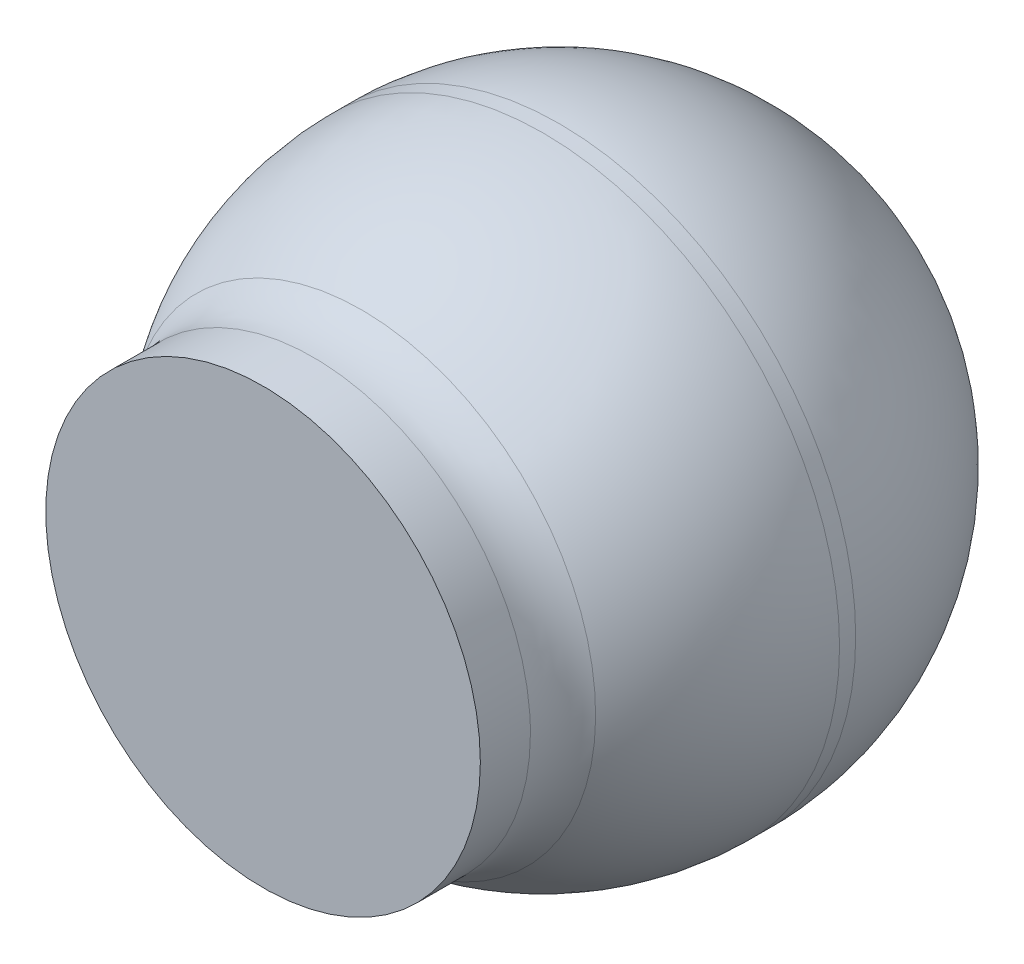
ISO-10303-21;
HEADER;
FILE_DESCRIPTION(('STEP AP214'),'2;1');
FILE_NAME('part.step','',(''),(''),'','','');
FILE_SCHEMA(('AUTOMOTIVE_DESIGN { 1 0 10303 214 1 1 1 1 }'));
ENDSEC;
DATA;
#1=APPLICATION_CONTEXT('core data for automotive mechanical design processes');
#2=APPLICATION_PROTOCOL_DEFINITION('international standard','automotive_design',2000,#1);
#3=PRODUCT_CONTEXT('',#1,'mechanical');
#4=PRODUCT('Part','Part','',(#3));
#5=PRODUCT_RELATED_PRODUCT_CATEGORY('part','',(#4));
#6=PRODUCT_DEFINITION_FORMATION('','',#4);
#7=PRODUCT_DEFINITION_CONTEXT('part definition',#1,'design');
#8=PRODUCT_DEFINITION('design','',#6,#7);
#9=PRODUCT_DEFINITION_SHAPE('','',#8);
#10=(LENGTH_UNIT() NAMED_UNIT(*) SI_UNIT(.MILLI.,.METRE.));
#11=(NAMED_UNIT(*) PLANE_ANGLE_UNIT() SI_UNIT($,.RADIAN.));
#12=(NAMED_UNIT(*) SI_UNIT($,.STERADIAN.) SOLID_ANGLE_UNIT());
#13=UNCERTAINTY_MEASURE_WITH_UNIT(LENGTH_MEASURE(1.E-05),#10,'distance_accuracy_value','');
#14=(GEOMETRIC_REPRESENTATION_CONTEXT(3) GLOBAL_UNCERTAINTY_ASSIGNED_CONTEXT((#13)) GLOBAL_UNIT_ASSIGNED_CONTEXT((#10,
#11,#12)) REPRESENTATION_CONTEXT('',''));
#15=CARTESIAN_POINT('',(0.,0.,0.));
#16=DIRECTION('',(0.,0.,1.));
#17=DIRECTION('',(1.,0.,0.));
#18=AXIS2_PLACEMENT_3D('',#15,#16,#17);
#19=CARTESIAN_POINT('',(-3.102919922269,-10.40134929145,10.006534503384));
#20=DIRECTION('',(0.,0.,-1.));
#21=DIRECTION('',(-1.,0.,0.));
#22=AXIS2_PLACEMENT_3D('',#19,#20,#21);
#23=PLANE('',#22);
#24=CARTESIAN_POINT('',(-3.102919922269,-10.40134929145,10.006534503384));
#25=DIRECTION('',(0.,0.,1.));
#26=DIRECTION('',(1.,0.,0.));
#27=AXIS2_PLACEMENT_3D('',#24,#25,#26);
#28=CIRCLE('',#27,0.275);
#29=CARTESIAN_POINT('',(-2.827919922269,-10.40134929145,10.006534503384));
#30=VERTEX_POINT('',#29);
#31=EDGE_CURVE('E20',#30,#30,#28,.F.);
#32=ORIENTED_EDGE('',*,*,#31,.F.);
#33=EDGE_LOOP('',(#32));
#34=FACE_BOUND('',#33,.T.);
#35=ADVANCED_FACE('F17',(#34),#23,.F.);
#36=CARTESIAN_POINT('',(-3.102919922269,-10.40134929145,9.906534503384));
#37=DIRECTION('',(0.,0.,1.));
#38=DIRECTION('',(1.,0.,0.));
#39=AXIS2_PLACEMENT_3D('',#36,#37,#38);
#40=CYLINDRICAL_SURFACE('',#39,0.275);
#41=CARTESIAN_POINT('',(-3.102919922269,-10.40134929145,9.943180457728));
#42=DIRECTION('',(0.,0.,-1.));
#43=DIRECTION('',(0.996700902337582,0.081162252799247,0.));
#44=AXIS2_PLACEMENT_3D('',#41,#42,#43);
#45=CIRCLE('',#44,0.275);
#46=CARTESIAN_POINT('',(-2.82882717412616,-10.3790296719302,9.943180457728));
#47=VERTEX_POINT('',#46);
#48=EDGE_CURVE('E66',#47,#47,#45,.F.);
#49=ORIENTED_EDGE('',*,*,#48,.T.);
#50=EDGE_LOOP('',(#49));
#51=FACE_BOUND('',#50,.T.);
#52=ORIENTED_EDGE('',*,*,#31,.T.);
#53=EDGE_LOOP('',(#52));
#54=FACE_BOUND('',#53,.T.);
#55=ADVANCED_FACE('F62',(#51,#54),#40,.T.);
#56=CARTESIAN_POINT('',(-3.102919922269,-10.40134929145,9.943180457728));
#57=DIRECTION('',(0.,0.,-1.));
#58=DIRECTION('',(0.996700902337583,0.0811622527992448,0.));
#59=AXIS2_PLACEMENT_3D('',#56,#57,#58);
#60=TOROIDAL_SURFACE('',#59,0.375,0.1);
#61=ORIENTED_EDGE('',*,*,#48,.F.);
#62=EDGE_LOOP('',(#61));
#63=FACE_BOUND('',#62,.T.);
#64=CARTESIAN_POINT('',(-3.102919922269,-10.40134929145,9.881744931236));
#65=DIRECTION('',(0.,0.,-1.));
#66=DIRECTION('',(-0.99670090233869,-0.0811622527856411,0.));
#67=AXIS2_PLACEMENT_3D('',#64,#65,#66);
#68=CIRCLE('',#67,0.29609704641234);
#69=CARTESIAN_POINT('',(-3.398040115608,-10.42538119478,9.881744931236));
#70=VERTEX_POINT('',#69);
#71=EDGE_CURVE('E39',#70,#70,#68,.T.);
#72=ORIENTED_EDGE('',*,*,#71,.F.);
#73=EDGE_LOOP('',(#72));
#74=FACE_BOUND('',#73,.T.);
#75=ADVANCED_FACE('F57',(#63,#74),#60,.F.);
#76=CARTESIAN_POINT('',(-3.476682760645,-10.43178513625,9.651976062157));
#77=CARTESIAN_POINT('',(-3.476682760645,-10.43178513625,9.701461392103));
#78=CARTESIAN_POINT('',(-3.468526217348,-10.43112094157,9.750947004335));
#79=CARTESIAN_POINT('',(-3.452207085349,-10.42979205995,9.798626332798));
#80=CARTESIAN_POINT('',(-3.428341390838,-10.42784865493,9.842699544317));
#81=CARTESIAN_POINT('',(-3.398040115608,-10.42538119478,9.881744931236));
#82=(BOUNDED_CURVE() B_SPLINE_CURVE(5,(#76,#77,#78,#79,#80,#81),.UNSPECIFIED.,.F.,
.F.) B_SPLINE_CURVE_WITH_KNOTS((6,6),(0.,0.661568582165),
.UNSPECIFIED.) CURVE() GEOMETRIC_REPRESENTATION_ITEM() RATIONAL_B_SPLINE_CURVE((1.,1.,1.,1.,1.,1.)) REPRESENTATION_ITEM(''));
#83=CARTESIAN_POINT('',(-3.102919922269,-10.40134929145,9.651976062157));
#84=DIRECTION('',(0.,0.,-1.));
#85=AXIS1_PLACEMENT('',#83,#84);
#86=SURFACE_OF_REVOLUTION('',#82,#85);
#87=CARTESIAN_POINT('',(-3.102919922269,-10.40134929145,9.651976062157));
#88=DIRECTION('',(0.,0.,1.));
#89=DIRECTION('',(1.,0.,0.));
#90=AXIS2_PLACEMENT_3D('',#87,#88,#89);
#91=CIRCLE('',#90,0.375);
#92=CARTESIAN_POINT('',(-2.727919922269,-10.40134929145,9.651976062157));
#93=VERTEX_POINT('',#92);
#94=EDGE_CURVE('E36',#93,#93,#91,.F.);
#95=ORIENTED_EDGE('',*,*,#94,.F.);
#96=EDGE_LOOP('',(#95));
#97=FACE_BOUND('',#96,.T.);
#98=ORIENTED_EDGE('',*,*,#71,.T.);
#99=EDGE_LOOP('',(#98));
#100=FACE_BOUND('',#99,.T.);
#101=ADVANCED_FACE('F53',(#97,#100),#86,.F.);
#102=CARTESIAN_POINT('',(-3.102919922269,-10.40134929145,9.256534503384));
#103=DIRECTION('',(0.,0.,1.));
#104=DIRECTION('',(1.,0.,0.));
#105=AXIS2_PLACEMENT_3D('',#102,#103,#104);
#106=CYLINDRICAL_SURFACE('',#105,0.375);
#107=CARTESIAN_POINT('',(-3.102919922269,-10.40134929145,9.631534503384));
#108=DIRECTION('',(0.,0.,-1.));
#109=DIRECTION('',(0.0811622527992357,-0.996700902337583,0.));
#110=AXIS2_PLACEMENT_3D('',#107,#108,#109);
#111=CIRCLE('',#110,0.375);
#112=CARTESIAN_POINT('',(-3.07248407746929,-10.7751121298266,9.631534503384));
#113=VERTEX_POINT('',#112);
#114=CARTESIAN_POINT('',(-3.13335576706871,-10.0275864530734,9.631534503384));
#115=VERTEX_POINT('',#114);
#116=EDGE_CURVE('E11',#113,#115,#111,.T.);
#117=ORIENTED_EDGE('',*,*,#116,.F.);
#118=CARTESIAN_POINT('',(-3.102919922269,-10.40134929145,9.631534503384));
#119=DIRECTION('',(3.33436315446763E-12,2.72100352061447E-13,1.));
#120=DIRECTION('',(0.0811622527992365,-0.996700902337583,0.));
#121=AXIS2_PLACEMENT_3D('',#118,#119,#120);
#122=CIRCLE('',#121,0.375);
#123=EDGE_CURVE('E25',#115,#113,#122,.F.);
#124=ORIENTED_EDGE('',*,*,#123,.F.);
#125=EDGE_LOOP('',(#117,#124));
#126=FACE_BOUND('',#125,.T.);
#127=ORIENTED_EDGE('',*,*,#94,.T.);
#128=EDGE_LOOP('',(#127));
#129=FACE_BOUND('',#128,.T.);
#130=ADVANCED_FACE('F34',(#126,#129),#106,.T.);
#131=CARTESIAN_POINT('',(-3.102919922269,-10.40134929145,9.631534503384));
#132=DIRECTION('',(0.0811622527992361,-0.996700902337583,0.));
#133=DIRECTION('',(-0.996700902337583,-0.0811622527992361,0.));
#134=AXIS2_PLACEMENT_3D('',#131,#132,#133);
#135=SPHERICAL_SURFACE('',#134,0.375);
#136=ORIENTED_EDGE('',*,*,#123,.T.);
#137=ORIENTED_EDGE('',*,*,#116,.T.);
#138=EDGE_LOOP('',(#136,#137));
#139=FACE_BOUND('',#138,.T.);
#140=ADVANCED_FACE('F32',(#139),#135,.T.);
#141=CLOSED_SHELL('',(#35,#55,#75,#101,#130,#140));
#142=MANIFOLD_SOLID_BREP('B1',#141);
#143=ADVANCED_BREP_SHAPE_REPRESENTATION('',(#18,#142),#14);
#144=SHAPE_DEFINITION_REPRESENTATION(#9,#143);
ENDSEC;
END-ISO-10303-21;
